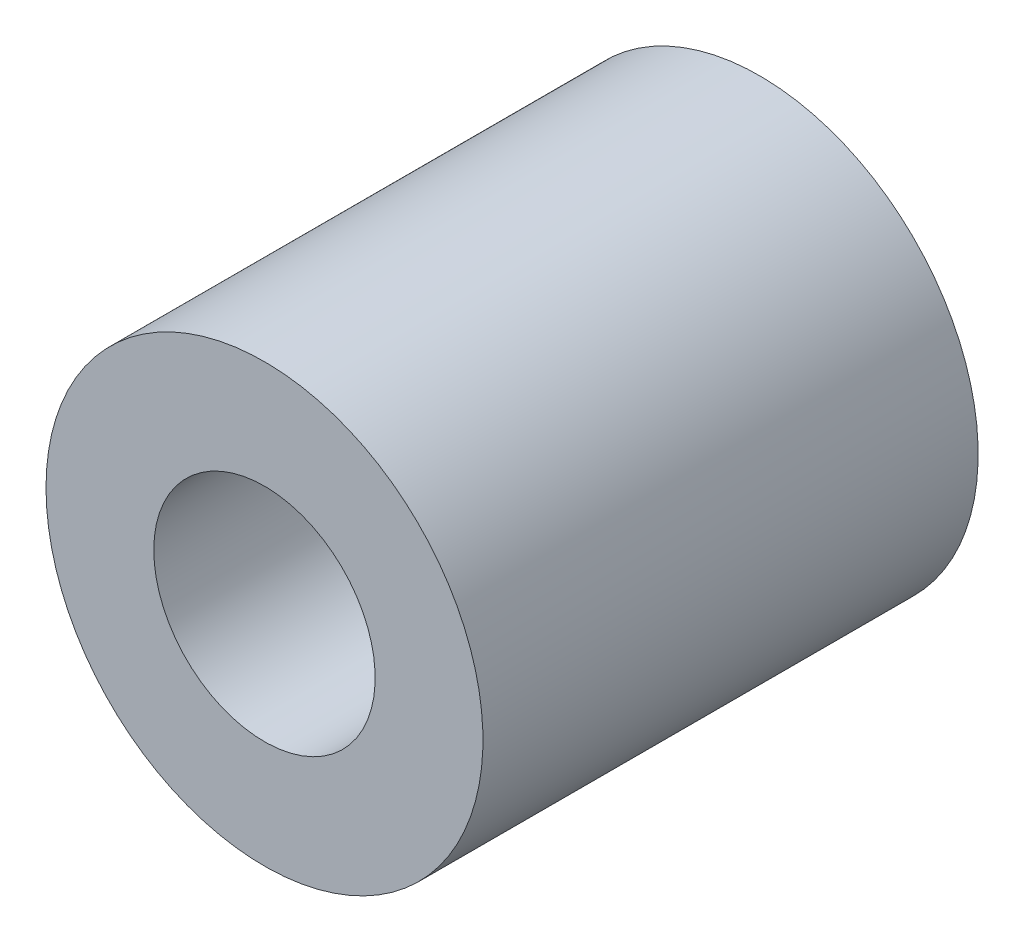
ISO-10303-21;
HEADER;
FILE_DESCRIPTION(('STEP AP214'),'2;1');
FILE_NAME('part.step','',(''),(''),'','','');
FILE_SCHEMA(('AUTOMOTIVE_DESIGN { 1 0 10303 214 1 1 1 1 }'));
ENDSEC;
DATA;
#1=APPLICATION_CONTEXT('core data for automotive mechanical design processes');
#2=APPLICATION_PROTOCOL_DEFINITION('international standard','automotive_design',2000,#1);
#3=PRODUCT_CONTEXT('',#1,'mechanical');
#4=PRODUCT('Part','Part','',(#3));
#5=PRODUCT_RELATED_PRODUCT_CATEGORY('part','',(#4));
#6=PRODUCT_DEFINITION_FORMATION('','',#4);
#7=PRODUCT_DEFINITION_CONTEXT('part definition',#1,'design');
#8=PRODUCT_DEFINITION('design','',#6,#7);
#9=PRODUCT_DEFINITION_SHAPE('','',#8);
#10=(LENGTH_UNIT() NAMED_UNIT(*) SI_UNIT(.MILLI.,.METRE.));
#11=(NAMED_UNIT(*) PLANE_ANGLE_UNIT() SI_UNIT($,.RADIAN.));
#12=(NAMED_UNIT(*) SI_UNIT($,.STERADIAN.) SOLID_ANGLE_UNIT());
#13=UNCERTAINTY_MEASURE_WITH_UNIT(LENGTH_MEASURE(1.E-05),#10,'distance_accuracy_value','');
#14=(GEOMETRIC_REPRESENTATION_CONTEXT(3) GLOBAL_UNCERTAINTY_ASSIGNED_CONTEXT((#13)) GLOBAL_UNIT_ASSIGNED_CONTEXT((#10,
#11,#12)) REPRESENTATION_CONTEXT('',''));
#15=CARTESIAN_POINT('',(0.,0.,0.));
#16=DIRECTION('',(0.,0.,1.));
#17=DIRECTION('',(1.,0.,0.));
#18=AXIS2_PLACEMENT_3D('',#15,#16,#17);
#19=CARTESIAN_POINT('',(0.,0.,21.59));
#20=DIRECTION('',(0.,0.,-1.));
#21=DIRECTION('',(-1.,0.,0.));
#22=AXIS2_PLACEMENT_3D('',#19,#20,#21);
#23=CYLINDRICAL_SURFACE('',#22,4.826);
#24=CARTESIAN_POINT('',(0.,0.,0.));
#25=DIRECTION('',(0.,0.,-1.));
#26=DIRECTION('',(-1.,0.,0.));
#27=AXIS2_PLACEMENT_3D('',#24,#25,#26);
#28=CIRCLE('',#27,4.826);
#29=CARTESIAN_POINT('',(-4.826,0.,0.));
#30=VERTEX_POINT('',#29);
#31=EDGE_CURVE('E28',#30,#30,#28,.T.);
#32=ORIENTED_EDGE('',*,*,#31,.T.);
#33=EDGE_LOOP('',(#32));
#34=FACE_BOUND('',#33,.T.);
#35=CARTESIAN_POINT('',(0.,0.,21.59));
#36=DIRECTION('',(0.,0.,-1.));
#37=DIRECTION('',(-1.,0.,0.));
#38=AXIS2_PLACEMENT_3D('',#35,#36,#37);
#39=CIRCLE('',#38,4.826);
#40=CARTESIAN_POINT('',(-4.826,0.,21.59));
#41=VERTEX_POINT('',#40);
#42=EDGE_CURVE('E19',#41,#41,#39,.T.);
#43=ORIENTED_EDGE('',*,*,#42,.F.);
#44=EDGE_LOOP('',(#43));
#45=FACE_BOUND('',#44,.T.);
#46=ADVANCED_FACE('F16',(#34,#45),#23,.F.);
#47=CARTESIAN_POINT('',(0.,0.,21.59));
#48=DIRECTION('',(0.,0.,1.));
#49=DIRECTION('',(1.,0.,0.));
#50=AXIS2_PLACEMENT_3D('',#47,#48,#49);
#51=PLANE('',#50);
#52=ORIENTED_EDGE('',*,*,#42,.T.);
#53=EDGE_LOOP('',(#52));
#54=FACE_BOUND('',#53,.T.);
#55=CARTESIAN_POINT('',(0.,0.,21.59));
#56=DIRECTION('',(0.,0.,-1.));
#57=DIRECTION('',(-1.,0.,0.));
#58=AXIS2_PLACEMENT_3D('',#55,#56,#57);
#59=CIRCLE('',#58,9.525);
#60=CARTESIAN_POINT('',(-9.525,0.,21.59));
#61=VERTEX_POINT('',#60);
#62=EDGE_CURVE('E23',#61,#61,#59,.T.);
#63=ORIENTED_EDGE('',*,*,#62,.F.);
#64=EDGE_LOOP('',(#63));
#65=FACE_BOUND('',#64,.T.);
#66=ADVANCED_FACE('F36',(#54,#65),#51,.T.);
#67=CARTESIAN_POINT('',(0.,0.,0.));
#68=DIRECTION('',(0.,0.,1.));
#69=DIRECTION('',(1.,0.,0.));
#70=AXIS2_PLACEMENT_3D('',#67,#68,#69);
#71=PLANE('',#70);
#72=ORIENTED_EDGE('',*,*,#31,.F.);
#73=EDGE_LOOP('',(#72));
#74=FACE_BOUND('',#73,.T.);
#75=CARTESIAN_POINT('',(0.,0.,0.));
#76=DIRECTION('',(0.,0.,-1.));
#77=DIRECTION('',(-1.,0.,0.));
#78=AXIS2_PLACEMENT_3D('',#75,#76,#77);
#79=CIRCLE('',#78,9.525);
#80=CARTESIAN_POINT('',(-9.525,0.,0.));
#81=VERTEX_POINT('',#80);
#82=EDGE_CURVE('E10',#81,#81,#79,.F.);
#83=ORIENTED_EDGE('',*,*,#82,.F.);
#84=EDGE_LOOP('',(#83));
#85=FACE_BOUND('',#84,.T.);
#86=ADVANCED_FACE('F43',(#74,#85),#71,.F.);
#87=CARTESIAN_POINT('',(0.,0.,21.59));
#88=DIRECTION('',(0.,0.,-1.));
#89=DIRECTION('',(-1.,0.,0.));
#90=AXIS2_PLACEMENT_3D('',#87,#88,#89);
#91=CYLINDRICAL_SURFACE('',#90,9.525);
#92=ORIENTED_EDGE('',*,*,#82,.T.);
#93=EDGE_LOOP('',(#92));
#94=FACE_BOUND('',#93,.T.);
#95=ORIENTED_EDGE('',*,*,#62,.T.);
#96=EDGE_LOOP('',(#95));
#97=FACE_BOUND('',#96,.T.);
#98=ADVANCED_FACE('F44',(#94,#97),#91,.T.);
#99=CLOSED_SHELL('',(#46,#66,#86,#98));
#100=MANIFOLD_SOLID_BREP('B1',#99);
#101=ADVANCED_BREP_SHAPE_REPRESENTATION('',(#18,#100),#14);
#102=SHAPE_DEFINITION_REPRESENTATION(#9,#101);
ENDSEC;
END-ISO-10303-21;
